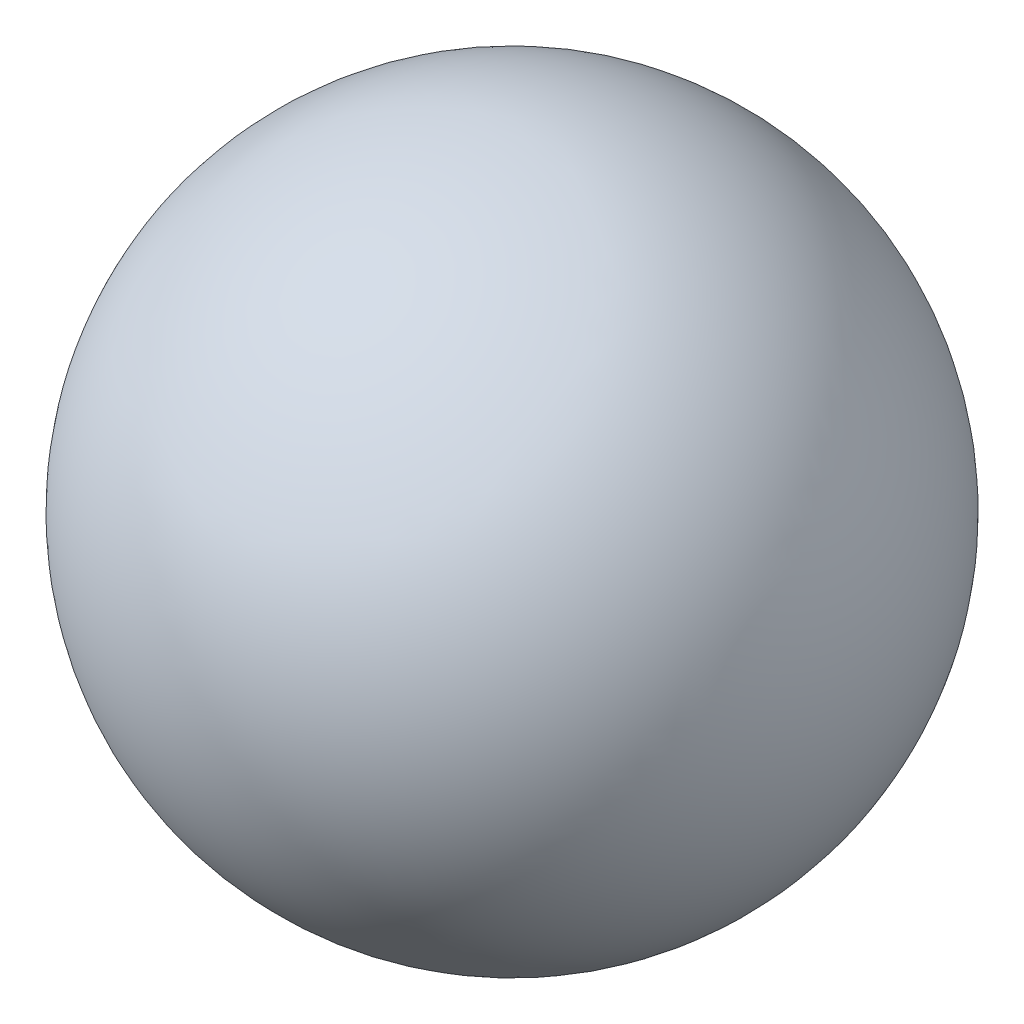
ISO-10303-21;
HEADER;
FILE_DESCRIPTION(('STEP AP214'),'2;1');
FILE_NAME('part.step','',(''),(''),'','','');
FILE_SCHEMA(('AUTOMOTIVE_DESIGN { 1 0 10303 214 1 1 1 1 }'));
ENDSEC;
DATA;
#1=APPLICATION_CONTEXT('core data for automotive mechanical design processes');
#2=APPLICATION_PROTOCOL_DEFINITION('international standard','automotive_design',2000,#1);
#3=PRODUCT_CONTEXT('',#1,'mechanical');
#4=PRODUCT('Part','Part','',(#3));
#5=PRODUCT_RELATED_PRODUCT_CATEGORY('part','',(#4));
#6=PRODUCT_DEFINITION_FORMATION('','',#4);
#7=PRODUCT_DEFINITION_CONTEXT('part definition',#1,'design');
#8=PRODUCT_DEFINITION('design','',#6,#7);
#9=PRODUCT_DEFINITION_SHAPE('','',#8);
#10=(LENGTH_UNIT() NAMED_UNIT(*) SI_UNIT(.MILLI.,.METRE.));
#11=(NAMED_UNIT(*) PLANE_ANGLE_UNIT() SI_UNIT($,.RADIAN.));
#12=(NAMED_UNIT(*) SI_UNIT($,.STERADIAN.) SOLID_ANGLE_UNIT());
#13=UNCERTAINTY_MEASURE_WITH_UNIT(LENGTH_MEASURE(1.E-05),#10,'distance_accuracy_value','');
#14=(GEOMETRIC_REPRESENTATION_CONTEXT(3) GLOBAL_UNCERTAINTY_ASSIGNED_CONTEXT((#13)) GLOBAL_UNIT_ASSIGNED_CONTEXT((#10,
#11,#12)) REPRESENTATION_CONTEXT('',''));
#15=CARTESIAN_POINT('',(0.,0.,0.));
#16=DIRECTION('',(0.,0.,1.));
#17=DIRECTION('',(1.,0.,0.));
#18=AXIS2_PLACEMENT_3D('',#15,#16,#17);
#19=CARTESIAN_POINT('',(25.5876775328048,98.3966423591404,103.43204004145));
#20=DIRECTION('',(-1.,0.,0.));
#21=DIRECTION('',(0.,-0.486545346961319,0.873655324112598));
#22=AXIS2_PLACEMENT_3D('',#19,#20,#21);
#23=SPHERICAL_SURFACE('',#22,1.292256);
#24=CARTESIAN_POINT('',(24.2954215328048,98.3966423591404,103.43204004145));
#25=VERTEX_POINT('',#24);
#26=VERTEX_LOOP('',#25);
#27=FACE_BOUND('',#26,.T.);
#28=ADVANCED_FACE('F39',(#27),#23,.T.);
#29=CLOSED_SHELL('',(#28));
#30=MANIFOLD_SOLID_BREP('B2',#29);
#31=ADVANCED_BREP_SHAPE_REPRESENTATION('',(#18,#30),#14);
#32=SHAPE_DEFINITION_REPRESENTATION(#9,#31);
ENDSEC;
END-ISO-10303-21;
